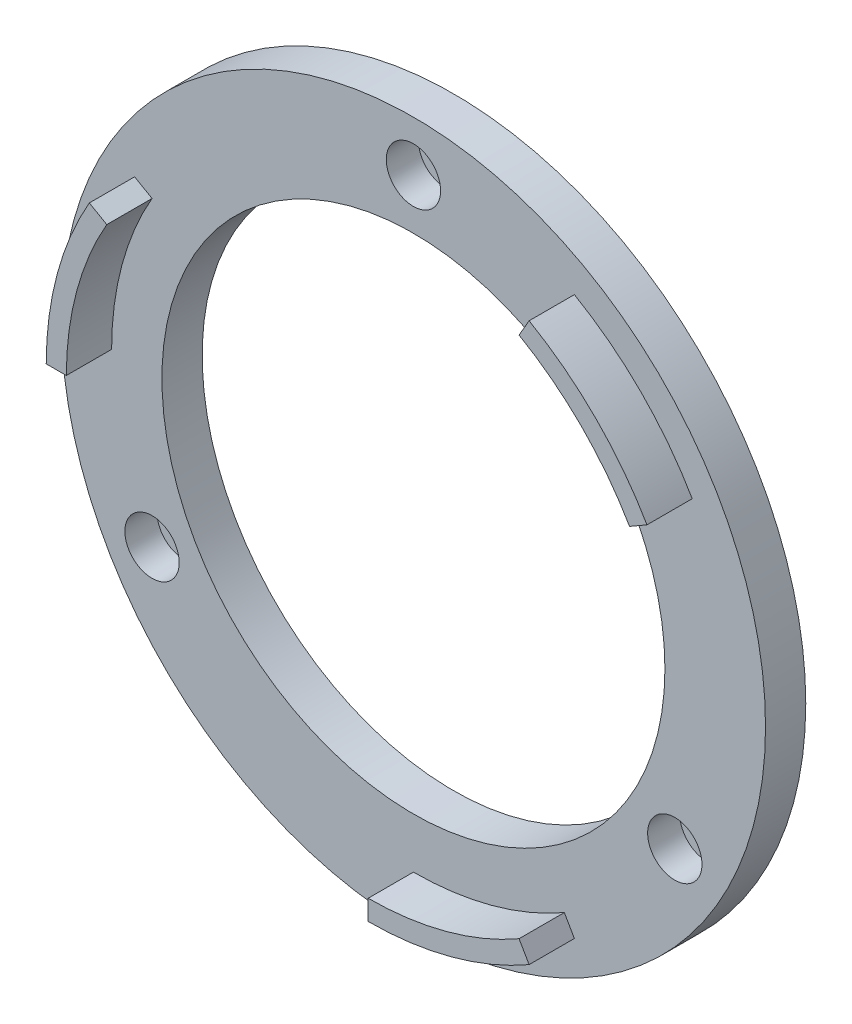
ISO-10303-21;
HEADER;
FILE_DESCRIPTION(('STEP AP214'),'2;1');
FILE_NAME('part.step','',(''),(''),'','','');
FILE_SCHEMA(('AUTOMOTIVE_DESIGN { 1 0 10303 214 1 1 1 1 }'));
ENDSEC;
DATA;
#1=APPLICATION_CONTEXT('core data for automotive mechanical design processes');
#2=APPLICATION_PROTOCOL_DEFINITION('international standard','automotive_design',2000,#1);
#3=PRODUCT_CONTEXT('',#1,'mechanical');
#4=PRODUCT('Part','Part','',(#3));
#5=PRODUCT_RELATED_PRODUCT_CATEGORY('part','',(#4));
#6=PRODUCT_DEFINITION_FORMATION('','',#4);
#7=PRODUCT_DEFINITION_CONTEXT('part definition',#1,'design');
#8=PRODUCT_DEFINITION('design','',#6,#7);
#9=PRODUCT_DEFINITION_SHAPE('','',#8);
#10=(LENGTH_UNIT() NAMED_UNIT(*) SI_UNIT(.MILLI.,.METRE.));
#11=(NAMED_UNIT(*) PLANE_ANGLE_UNIT() SI_UNIT($,.RADIAN.));
#12=(NAMED_UNIT(*) SI_UNIT($,.STERADIAN.) SOLID_ANGLE_UNIT());
#13=UNCERTAINTY_MEASURE_WITH_UNIT(LENGTH_MEASURE(1.E-05),#10,'distance_accuracy_value','');
#14=(GEOMETRIC_REPRESENTATION_CONTEXT(3) GLOBAL_UNCERTAINTY_ASSIGNED_CONTEXT((#13)) GLOBAL_UNIT_ASSIGNED_CONTEXT((#10,
#11,#12)) REPRESENTATION_CONTEXT('',''));
#15=CARTESIAN_POINT('',(0.,0.,0.));
#16=DIRECTION('',(0.,0.,1.));
#17=DIRECTION('',(1.,0.,0.));
#18=AXIS2_PLACEMENT_3D('',#15,#16,#17);
#19=CARTESIAN_POINT('',(-25.9807621135351,-14.9999999999989,7.9));
#20=DIRECTION('',(0.,0.,-1.));
#21=DIRECTION('',(-1.,0.,0.));
#22=AXIS2_PLACEMENT_3D('',#19,#20,#21);
#23=CYLINDRICAL_SURFACE('',#22,1.60000000000166);
#24=CARTESIAN_POINT('',(-25.9807621135351,-14.9999999999989,0.8));
#25=DIRECTION('',(0.,0.,1.));
#26=DIRECTION('',(1.,0.,0.));
#27=AXIS2_PLACEMENT_3D('',#24,#25,#26);
#28=CIRCLE('',#27,1.60000000000166);
#29=CARTESIAN_POINT('',(-24.3807621135334,-14.9999999999989,0.8));
#30=VERTEX_POINT('',#29);
#31=EDGE_CURVE('E43',#30,#30,#28,.F.);
#32=ORIENTED_EDGE('',*,*,#31,.F.);
#33=EDGE_LOOP('',(#32));
#34=FACE_BOUND('',#33,.T.);
#35=CARTESIAN_POINT('',(-25.9807621135351,-14.9999999999989,0.));
#36=DIRECTION('',(0.,0.,-1.));
#37=DIRECTION('',(-1.,0.,0.));
#38=AXIS2_PLACEMENT_3D('',#35,#36,#37);
#39=CIRCLE('',#38,1.60000000000166);
#40=CARTESIAN_POINT('',(-27.5807621135367,-14.9999999999989,0.));
#41=VERTEX_POINT('',#40);
#42=EDGE_CURVE('E267',#41,#41,#39,.F.);
#43=ORIENTED_EDGE('',*,*,#42,.F.);
#44=EDGE_LOOP('',(#43));
#45=FACE_BOUND('',#44,.T.);
#46=ADVANCED_FACE('F39',(#34,#45),#23,.F.);
#47=CARTESIAN_POINT('',(25.9807621135312,-15.0000000000011,7.9));
#48=DIRECTION('',(0.,0.,-1.));
#49=DIRECTION('',(-1.,0.,0.));
#50=AXIS2_PLACEMENT_3D('',#47,#48,#49);
#51=CYLINDRICAL_SURFACE('',#50,1.60000000000243);
#52=CARTESIAN_POINT('',(25.9807621135312,-15.0000000000011,0.8));
#53=DIRECTION('',(0.,0.,1.));
#54=DIRECTION('',(1.,0.,0.));
#55=AXIS2_PLACEMENT_3D('',#52,#53,#54);
#56=CIRCLE('',#55,1.60000000000243);
#57=CARTESIAN_POINT('',(27.5807621135337,-15.0000000000011,0.8));
#58=VERTEX_POINT('',#57);
#59=EDGE_CURVE('E252',#58,#58,#56,.F.);
#60=ORIENTED_EDGE('',*,*,#59,.F.);
#61=EDGE_LOOP('',(#60));
#62=FACE_BOUND('',#61,.T.);
#63=CARTESIAN_POINT('',(25.9807621135312,-15.0000000000011,0.));
#64=DIRECTION('',(0.,0.,-1.));
#65=DIRECTION('',(-1.,0.,0.));
#66=AXIS2_PLACEMENT_3D('',#63,#64,#65);
#67=CIRCLE('',#66,1.60000000000243);
#68=CARTESIAN_POINT('',(24.3807621135288,-15.0000000000011,0.));
#69=VERTEX_POINT('',#68);
#70=EDGE_CURVE('E269',#69,#69,#67,.F.);
#71=ORIENTED_EDGE('',*,*,#70,.F.);
#72=EDGE_LOOP('',(#71));
#73=FACE_BOUND('',#72,.T.);
#74=ADVANCED_FACE('F263',(#62,#73),#51,.F.);
#75=CARTESIAN_POINT('',(0.,30.,7.9));
#76=DIRECTION('',(0.,0.,-1.));
#77=DIRECTION('',(-1.,0.,0.));
#78=AXIS2_PLACEMENT_3D('',#75,#76,#77);
#79=CYLINDRICAL_SURFACE('',#78,1.6);
#80=CARTESIAN_POINT('',(0.,30.,0.8));
#81=DIRECTION('',(0.,0.,1.));
#82=DIRECTION('',(1.,0.,0.));
#83=AXIS2_PLACEMENT_3D('',#80,#81,#82);
#84=CIRCLE('',#83,1.6);
#85=CARTESIAN_POINT('',(1.6,30.,0.8));
#86=VERTEX_POINT('',#85);
#87=EDGE_CURVE('E228',#86,#86,#84,.F.);
#88=ORIENTED_EDGE('',*,*,#87,.F.);
#89=EDGE_LOOP('',(#88));
#90=FACE_BOUND('',#89,.T.);
#91=CARTESIAN_POINT('',(0.,30.,0.));
#92=DIRECTION('',(0.,0.,-1.));
#93=DIRECTION('',(-1.,0.,0.));
#94=AXIS2_PLACEMENT_3D('',#91,#92,#93);
#95=CIRCLE('',#94,1.6);
#96=CARTESIAN_POINT('',(-1.6,30.,0.));
#97=VERTEX_POINT('',#96);
#98=EDGE_CURVE('E272',#97,#97,#95,.F.);
#99=ORIENTED_EDGE('',*,*,#98,.F.);
#100=EDGE_LOOP('',(#99));
#101=FACE_BOUND('',#100,.T.);
#102=ADVANCED_FACE('F359',(#90,#101),#79,.F.);
#103=CARTESIAN_POINT('',(0.,0.,4.));
#104=DIRECTION('',(0.,0.,1.));
#105=DIRECTION('',(1.,0.,0.));
#106=AXIS2_PLACEMENT_3D('',#103,#104,#105);
#107=PLANE('',#106);
#108=CARTESIAN_POINT('',(0.,0.,4.));
#109=DIRECTION('',(0.,0.,1.));
#110=DIRECTION('',(1.,0.,0.));
#111=AXIS2_PLACEMENT_3D('',#108,#109,#110);
#112=CIRCLE('',#111,30.);
#113=CARTESIAN_POINT('',(25.9807621135331,15.,4.));
#114=VERTEX_POINT('',#113);
#115=CARTESIAN_POINT('',(14.9999999999999,25.9807621135332,4.));
#116=VERTEX_POINT('',#115);
#117=EDGE_CURVE('E184',#114,#116,#112,.T.);
#118=ORIENTED_EDGE('',*,*,#117,.T.);
#119=DIRECTION('',(0.499999999999998,0.86602540378444,0.));
#120=VECTOR('',#119,1.);
#121=CARTESIAN_POINT('',(0.,0.,4.));
#122=LINE('',#121,#120);
#123=CARTESIAN_POINT('',(15.9999999999999,27.7128129211021,4.));
#124=VERTEX_POINT('',#123);
#125=EDGE_CURVE('E197',#116,#124,#122,.T.);
#126=ORIENTED_EDGE('',*,*,#125,.T.);
#127=CARTESIAN_POINT('',(0.,0.,4.));
#128=DIRECTION('',(0.,0.,1.));
#129=DIRECTION('',(1.,0.,0.));
#130=AXIS2_PLACEMENT_3D('',#127,#128,#129);
#131=CIRCLE('',#130,32.);
#132=CARTESIAN_POINT('',(27.712812921102,16.,4.));
#133=VERTEX_POINT('',#132);
#134=EDGE_CURVE('E209',#133,#124,#131,.T.);
#135=ORIENTED_EDGE('',*,*,#134,.F.);
#136=DIRECTION('',(0.866025403784438,0.500000000000001,0.));
#137=VECTOR('',#136,1.);
#138=CARTESIAN_POINT('',(0.,0.,4.));
#139=LINE('',#138,#137);
#140=EDGE_CURVE('E206',#114,#133,#139,.T.);
#141=ORIENTED_EDGE('',*,*,#140,.F.);
#142=EDGE_LOOP('',(#118,#126,#135,#141));
#143=FACE_BOUND('',#142,.T.);
#144=CARTESIAN_POINT('',(0.,30.,4.));
#145=DIRECTION('',(0.,0.,1.));
#146=DIRECTION('',(1.,0.,0.));
#147=AXIS2_PLACEMENT_3D('',#144,#145,#146);
#148=CIRCLE('',#147,2.7);
#149=CARTESIAN_POINT('',(2.7,30.,4.));
#150=VERTEX_POINT('',#149);
#151=EDGE_CURVE('E229',#150,#150,#148,.T.);
#152=ORIENTED_EDGE('',*,*,#151,.F.);
#153=EDGE_LOOP('',(#152));
#154=FACE_BOUND('',#153,.T.);
#155=CARTESIAN_POINT('',(25.9807621135351,-14.9999999999989,4.));
#156=DIRECTION('',(0.,0.,1.));
#157=DIRECTION('',(1.,0.,0.));
#158=AXIS2_PLACEMENT_3D('',#155,#156,#157);
#159=CIRCLE('',#158,2.70000000000167);
#160=CARTESIAN_POINT('',(28.6807621135367,-14.9999999999989,4.));
#161=VERTEX_POINT('',#160);
#162=EDGE_CURVE('E232',#161,#161,#159,.T.);
#163=ORIENTED_EDGE('',*,*,#162,.F.);
#164=EDGE_LOOP('',(#163));
#165=FACE_BOUND('',#164,.T.);
#166=CARTESIAN_POINT('',(-25.9807621135312,-15.0000000000011,4.));
#167=DIRECTION('',(0.,0.,1.));
#168=DIRECTION('',(1.,0.,0.));
#169=AXIS2_PLACEMENT_3D('',#166,#167,#168);
#170=CIRCLE('',#169,2.70000000000243);
#171=CARTESIAN_POINT('',(-23.2807621135288,-15.0000000000011,4.));
#172=VERTEX_POINT('',#171);
#173=EDGE_CURVE('E238',#172,#172,#170,.T.);
#174=ORIENTED_EDGE('',*,*,#173,.F.);
#175=EDGE_LOOP('',(#174));
#176=FACE_BOUND('',#175,.T.);
#177=CARTESIAN_POINT('',(0.,0.,4.));
#178=DIRECTION('',(0.,0.,1.));
#179=DIRECTION('',(1.,0.,0.));
#180=AXIS2_PLACEMENT_3D('',#177,#178,#179);
#181=CIRCLE('',#180,35.);
#182=CARTESIAN_POINT('',(35.,0.,4.));
#183=VERTEX_POINT('',#182);
#184=EDGE_CURVE('E48',#183,#183,#181,.T.);
#185=ORIENTED_EDGE('',*,*,#184,.T.);
#186=EDGE_LOOP('',(#185));
#187=FACE_BOUND('',#186,.T.);
#188=CARTESIAN_POINT('',(0.,0.,4.));
#189=DIRECTION('',(0.,0.,1.));
#190=DIRECTION('',(1.,0.,0.));
#191=AXIS2_PLACEMENT_3D('',#188,#189,#190);
#192=CIRCLE('',#191,25.);
#193=CARTESIAN_POINT('',(25.,0.,4.));
#194=VERTEX_POINT('',#193);
#195=EDGE_CURVE('E11',#194,#194,#192,.T.);
#196=ORIENTED_EDGE('',*,*,#195,.F.);
#197=EDGE_LOOP('',(#196));
#198=FACE_BOUND('',#197,.T.);
#199=DIRECTION('',(1.,0.,0.));
#200=VECTOR('',#199,1.);
#201=CARTESIAN_POINT('',(-32.,2.15105711021124E-13,4.));
#202=LINE('',#201,#200);
#203=CARTESIAN_POINT('',(-32.,2.15105711021124E-13,4.));
#204=VERTEX_POINT('',#203);
#205=CARTESIAN_POINT('',(-30.,2.02962646689286E-13,4.));
#206=VERTEX_POINT('',#205);
#207=EDGE_CURVE('E178',#204,#206,#202,.T.);
#208=ORIENTED_EDGE('',*,*,#207,.F.);
#209=CARTESIAN_POINT('',(0.,0.,4.));
#210=DIRECTION('',(0.,0.,1.));
#211=DIRECTION('',(1.,0.,0.));
#212=AXIS2_PLACEMENT_3D('',#209,#210,#211);
#213=CIRCLE('',#212,32.);
#214=CARTESIAN_POINT('',(-27.7128129211019,16.0000000000002,4.));
#215=VERTEX_POINT('',#214);
#216=EDGE_CURVE('E181',#215,#204,#213,.T.);
#217=ORIENTED_EDGE('',*,*,#216,.F.);
#218=DIRECTION('',(-0.866025403784435,0.500000000000007,0.));
#219=VECTOR('',#218,1.);
#220=CARTESIAN_POINT('',(-25.980762113533,15.0000000000002,4.));
#221=LINE('',#220,#219);
#222=CARTESIAN_POINT('',(-25.980762113533,15.0000000000002,4.));
#223=VERTEX_POINT('',#222);
#224=EDGE_CURVE('E174',#223,#215,#221,.T.);
#225=ORIENTED_EDGE('',*,*,#224,.F.);
#226=CARTESIAN_POINT('',(0.,0.,4.));
#227=DIRECTION('',(0.,0.,1.));
#228=DIRECTION('',(1.,0.,0.));
#229=AXIS2_PLACEMENT_3D('',#226,#227,#228);
#230=CIRCLE('',#229,30.);
#231=EDGE_CURVE('E64',#223,#206,#230,.T.);
#232=ORIENTED_EDGE('',*,*,#231,.T.);
#233=EDGE_LOOP('',(#208,#217,#225,#232));
#234=FACE_BOUND('',#233,.T.);
#235=DIRECTION('',(-0.499999999999998,0.86602540378444,0.));
#236=VECTOR('',#235,1.);
#237=CARTESIAN_POINT('',(15.9999999999999,-27.7128129211021,4.));
#238=LINE('',#237,#236);
#239=CARTESIAN_POINT('',(15.9999999999999,-27.7128129211021,4.));
#240=VERTEX_POINT('',#239);
#241=CARTESIAN_POINT('',(14.9999999999999,-25.9807621135332,4.));
#242=VERTEX_POINT('',#241);
#243=EDGE_CURVE('E152',#240,#242,#238,.T.);
#244=ORIENTED_EDGE('',*,*,#243,.F.);
#245=CARTESIAN_POINT('',(0.,0.,4.));
#246=DIRECTION('',(0.,0.,1.));
#247=DIRECTION('',(1.,0.,0.));
#248=AXIS2_PLACEMENT_3D('',#245,#246,#247);
#249=CIRCLE('',#248,32.);
#250=CARTESIAN_POINT('',(-1.12757025938492E-13,-32.,4.));
#251=VERTEX_POINT('',#250);
#252=EDGE_CURVE('E145',#251,#240,#249,.T.);
#253=ORIENTED_EDGE('',*,*,#252,.F.);
#254=DIRECTION('',(0.,-1.,0.));
#255=VECTOR('',#254,1.);
#256=CARTESIAN_POINT('',(-1.05818132034585E-13,-30.,4.));
#257=LINE('',#256,#255);
#258=CARTESIAN_POINT('',(-1.05818132034585E-13,-30.,4.));
#259=VERTEX_POINT('',#258);
#260=EDGE_CURVE('E130',#259,#251,#257,.T.);
#261=ORIENTED_EDGE('',*,*,#260,.F.);
#262=CARTESIAN_POINT('',(0.,0.,4.));
#263=DIRECTION('',(0.,0.,1.));
#264=DIRECTION('',(1.,0.,0.));
#265=AXIS2_PLACEMENT_3D('',#262,#263,#264);
#266=CIRCLE('',#265,30.);
#267=EDGE_CURVE('E56',#259,#242,#266,.T.);
#268=ORIENTED_EDGE('',*,*,#267,.T.);
#269=EDGE_LOOP('',(#244,#253,#261,#268));
#270=FACE_BOUND('',#269,.T.);
#271=ADVANCED_FACE('F150',(#143,#154,#165,#176,#187,#198,#234,#270),#107,.T.);
#272=CARTESIAN_POINT('',(0.,0.,4.));
#273=DIRECTION('',(0.,0.,-1.));
#274=DIRECTION('',(-1.,0.,0.));
#275=AXIS2_PLACEMENT_3D('',#272,#273,#274);
#276=CYLINDRICAL_SURFACE('',#275,35.);
#277=ORIENTED_EDGE('',*,*,#184,.F.);
#278=EDGE_LOOP('',(#277));
#279=FACE_BOUND('',#278,.T.);
#280=CARTESIAN_POINT('',(0.,0.,0.));
#281=DIRECTION('',(0.,0.,1.));
#282=DIRECTION('',(1.,0.,0.));
#283=AXIS2_PLACEMENT_3D('',#280,#281,#282);
#284=CIRCLE('',#283,35.);
#285=CARTESIAN_POINT('',(35.,0.,0.));
#286=VERTEX_POINT('',#285);
#287=EDGE_CURVE('E246',#286,#286,#284,.T.);
#288=ORIENTED_EDGE('',*,*,#287,.T.);
#289=EDGE_LOOP('',(#288));
#290=FACE_BOUND('',#289,.T.);
#291=ADVANCED_FACE('F41',(#279,#290),#276,.T.);
#292=CARTESIAN_POINT('',(0.,0.,4.));
#293=DIRECTION('',(0.,0.,-1.));
#294=DIRECTION('',(-1.,0.,0.));
#295=AXIS2_PLACEMENT_3D('',#292,#293,#294);
#296=CYLINDRICAL_SURFACE('',#295,25.);
#297=ORIENTED_EDGE('',*,*,#195,.T.);
#298=EDGE_LOOP('',(#297));
#299=FACE_BOUND('',#298,.T.);
#300=CARTESIAN_POINT('',(0.,0.,0.));
#301=DIRECTION('',(0.,0.,1.));
#302=DIRECTION('',(1.,0.,0.));
#303=AXIS2_PLACEMENT_3D('',#300,#301,#302);
#304=CIRCLE('',#303,25.);
#305=CARTESIAN_POINT('',(25.,0.,0.));
#306=VERTEX_POINT('',#305);
#307=EDGE_CURVE('E244',#306,#306,#304,.T.);
#308=ORIENTED_EDGE('',*,*,#307,.F.);
#309=EDGE_LOOP('',(#308));
#310=FACE_BOUND('',#309,.T.);
#311=ADVANCED_FACE('F370',(#299,#310),#296,.F.);
#312=CARTESIAN_POINT('',(0.,0.,0.));
#313=DIRECTION('',(0.,0.,1.));
#314=DIRECTION('',(1.,0.,0.));
#315=AXIS2_PLACEMENT_3D('',#312,#313,#314);
#316=PLANE('',#315);
#317=ORIENTED_EDGE('',*,*,#287,.F.);
#318=EDGE_LOOP('',(#317));
#319=FACE_BOUND('',#318,.T.);
#320=ORIENTED_EDGE('',*,*,#307,.T.);
#321=EDGE_LOOP('',(#320));
#322=FACE_BOUND('',#321,.T.);
#323=ORIENTED_EDGE('',*,*,#42,.T.);
#324=EDGE_LOOP('',(#323));
#325=FACE_BOUND('',#324,.T.);
#326=ORIENTED_EDGE('',*,*,#70,.T.);
#327=EDGE_LOOP('',(#326));
#328=FACE_BOUND('',#327,.T.);
#329=ORIENTED_EDGE('',*,*,#98,.T.);
#330=EDGE_LOOP('',(#329));
#331=FACE_BOUND('',#330,.T.);
#332=ADVANCED_FACE('F340',(#319,#322,#325,#328,#331),#316,.F.);
#333=CARTESIAN_POINT('',(0.,30.,0.8));
#334=DIRECTION('',(0.,0.,1.));
#335=DIRECTION('',(1.,0.,0.));
#336=AXIS2_PLACEMENT_3D('',#333,#334,#335);
#337=PLANE('',#336);
#338=CARTESIAN_POINT('',(0.,30.,0.8));
#339=DIRECTION('',(0.,0.,1.));
#340=DIRECTION('',(1.,0.,0.));
#341=AXIS2_PLACEMENT_3D('',#338,#339,#340);
#342=CIRCLE('',#341,2.7);
#343=CARTESIAN_POINT('',(2.7,30.,0.8));
#344=VERTEX_POINT('',#343);
#345=EDGE_CURVE('E225',#344,#344,#342,.T.);
#346=ORIENTED_EDGE('',*,*,#345,.T.);
#347=EDGE_LOOP('',(#346));
#348=FACE_BOUND('',#347,.T.);
#349=ORIENTED_EDGE('',*,*,#87,.T.);
#350=EDGE_LOOP('',(#349));
#351=FACE_BOUND('',#350,.T.);
#352=ADVANCED_FACE('F336',(#348,#351),#337,.T.);
#353=CARTESIAN_POINT('',(0.,30.,0.8));
#354=DIRECTION('',(0.,0.,1.));
#355=DIRECTION('',(1.,0.,0.));
#356=AXIS2_PLACEMENT_3D('',#353,#354,#355);
#357=CYLINDRICAL_SURFACE('',#356,2.7);
#358=ORIENTED_EDGE('',*,*,#345,.F.);
#359=EDGE_LOOP('',(#358));
#360=FACE_BOUND('',#359,.T.);
#361=ORIENTED_EDGE('',*,*,#151,.T.);
#362=EDGE_LOOP('',(#361));
#363=FACE_BOUND('',#362,.T.);
#364=ADVANCED_FACE('F339',(#360,#363),#357,.F.);
#365=CARTESIAN_POINT('',(25.9807621135351,-14.9999999999989,0.8));
#366=DIRECTION('',(0.,0.,1.));
#367=DIRECTION('',(1.,0.,0.));
#368=AXIS2_PLACEMENT_3D('',#365,#366,#367);
#369=PLANE('',#368);
#370=CARTESIAN_POINT('',(25.9807621135351,-14.9999999999989,0.8));
#371=DIRECTION('',(0.,0.,1.));
#372=DIRECTION('',(1.,0.,0.));
#373=AXIS2_PLACEMENT_3D('',#370,#371,#372);
#374=CIRCLE('',#373,2.70000000000167);
#375=CARTESIAN_POINT('',(28.6807621135367,-14.9999999999989,0.8));
#376=VERTEX_POINT('',#375);
#377=EDGE_CURVE('E235',#376,#376,#374,.T.);
#378=ORIENTED_EDGE('',*,*,#377,.T.);
#379=EDGE_LOOP('',(#378));
#380=FACE_BOUND('',#379,.T.);
#381=ORIENTED_EDGE('',*,*,#59,.T.);
#382=EDGE_LOOP('',(#381));
#383=FACE_BOUND('',#382,.T.);
#384=ADVANCED_FACE('F344',(#380,#383),#369,.T.);
#385=CARTESIAN_POINT('',(25.9807621135351,-14.9999999999989,0.8));
#386=DIRECTION('',(0.,0.,1.));
#387=DIRECTION('',(1.,0.,0.));
#388=AXIS2_PLACEMENT_3D('',#385,#386,#387);
#389=CYLINDRICAL_SURFACE('',#388,2.70000000000167);
#390=ORIENTED_EDGE('',*,*,#377,.F.);
#391=EDGE_LOOP('',(#390));
#392=FACE_BOUND('',#391,.T.);
#393=ORIENTED_EDGE('',*,*,#162,.T.);
#394=EDGE_LOOP('',(#393));
#395=FACE_BOUND('',#394,.T.);
#396=ADVANCED_FACE('F346',(#392,#395),#389,.F.);
#397=CARTESIAN_POINT('',(-25.9807621135312,-15.0000000000011,0.8));
#398=DIRECTION('',(0.,0.,1.));
#399=DIRECTION('',(1.,0.,0.));
#400=AXIS2_PLACEMENT_3D('',#397,#398,#399);
#401=PLANE('',#400);
#402=CARTESIAN_POINT('',(-25.9807621135312,-15.0000000000011,0.8));
#403=DIRECTION('',(0.,0.,1.));
#404=DIRECTION('',(1.,0.,0.));
#405=AXIS2_PLACEMENT_3D('',#402,#403,#404);
#406=CIRCLE('',#405,2.70000000000243);
#407=CARTESIAN_POINT('',(-23.2807621135288,-15.0000000000011,0.8));
#408=VERTEX_POINT('',#407);
#409=EDGE_CURVE('E224',#408,#408,#406,.T.);
#410=ORIENTED_EDGE('',*,*,#409,.T.);
#411=EDGE_LOOP('',(#410));
#412=FACE_BOUND('',#411,.T.);
#413=ORIENTED_EDGE('',*,*,#31,.T.);
#414=EDGE_LOOP('',(#413));
#415=FACE_BOUND('',#414,.T.);
#416=ADVANCED_FACE('F259',(#412,#415),#401,.T.);
#417=CARTESIAN_POINT('',(-25.9807621135312,-15.0000000000011,0.8));
#418=DIRECTION('',(0.,0.,1.));
#419=DIRECTION('',(1.,0.,0.));
#420=AXIS2_PLACEMENT_3D('',#417,#418,#419);
#421=CYLINDRICAL_SURFACE('',#420,2.70000000000243);
#422=ORIENTED_EDGE('',*,*,#409,.F.);
#423=EDGE_LOOP('',(#422));
#424=FACE_BOUND('',#423,.T.);
#425=ORIENTED_EDGE('',*,*,#173,.T.);
#426=EDGE_LOOP('',(#425));
#427=FACE_BOUND('',#426,.T.);
#428=ADVANCED_FACE('F334',(#424,#427),#421,.F.);
#429=CARTESIAN_POINT('',(0.,0.,8.5));
#430=DIRECTION('',(0.,0.,-1.));
#431=DIRECTION('',(-1.,0.,0.));
#432=AXIS2_PLACEMENT_3D('',#429,#430,#431);
#433=CYLINDRICAL_SURFACE('',#432,30.);
#434=ORIENTED_EDGE('',*,*,#117,.F.);
#435=DIRECTION('',(0.,0.,-1.));
#436=VECTOR('',#435,1.);
#437=CARTESIAN_POINT('',(25.9807621135331,15.,8.5));
#438=LINE('',#437,#436);
#439=CARTESIAN_POINT('',(25.9807621135331,15.,8.5));
#440=VERTEX_POINT('',#439);
#441=EDGE_CURVE('E221',#440,#114,#438,.T.);
#442=ORIENTED_EDGE('',*,*,#441,.F.);
#443=CARTESIAN_POINT('',(0.,0.,8.5));
#444=DIRECTION('',(0.,0.,1.));
#445=DIRECTION('',(1.,0.,0.));
#446=AXIS2_PLACEMENT_3D('',#443,#444,#445);
#447=CIRCLE('',#446,30.);
#448=CARTESIAN_POINT('',(14.9999999999999,25.9807621135332,8.5));
#449=VERTEX_POINT('',#448);
#450=EDGE_CURVE('E193',#440,#449,#447,.T.);
#451=ORIENTED_EDGE('',*,*,#450,.T.);
#452=DIRECTION('',(0.,0.,-1.));
#453=VECTOR('',#452,1.);
#454=CARTESIAN_POINT('',(14.9999999999999,25.9807621135332,8.5));
#455=LINE('',#454,#453);
#456=EDGE_CURVE('E204',#449,#116,#455,.T.);
#457=ORIENTED_EDGE('',*,*,#456,.T.);
#458=EDGE_LOOP('',(#434,#442,#451,#457));
#459=FACE_BOUND('',#458,.T.);
#460=ADVANCED_FACE('F330',(#459),#433,.F.);
#461=CARTESIAN_POINT('',(0.,0.,8.5));
#462=DIRECTION('',(-0.500000000000001,0.866025403784438,0.));
#463=DIRECTION('',(-0.866025403784438,-0.500000000000001,0.));
#464=AXIS2_PLACEMENT_3D('',#461,#462,#463);
#465=PLANE('',#464);
#466=ORIENTED_EDGE('',*,*,#140,.T.);
#467=DIRECTION('',(0.,0.,-1.));
#468=VECTOR('',#467,1.);
#469=CARTESIAN_POINT('',(27.712812921102,16.,8.5));
#470=LINE('',#469,#468);
#471=CARTESIAN_POINT('',(27.712812921102,16.,8.5));
#472=VERTEX_POINT('',#471);
#473=EDGE_CURVE('E218',#472,#133,#470,.T.);
#474=ORIENTED_EDGE('',*,*,#473,.F.);
#475=DIRECTION('',(0.866025403784438,0.500000000000001,0.));
#476=VECTOR('',#475,1.);
#477=CARTESIAN_POINT('',(0.,0.,8.5));
#478=LINE('',#477,#476);
#479=EDGE_CURVE('E196',#440,#472,#478,.T.);
#480=ORIENTED_EDGE('',*,*,#479,.F.);
#481=ORIENTED_EDGE('',*,*,#441,.T.);
#482=EDGE_LOOP('',(#466,#474,#480,#481));
#483=FACE_BOUND('',#482,.T.);
#484=ADVANCED_FACE('F326',(#483),#465,.F.);
#485=CARTESIAN_POINT('',(0.,0.,8.5));
#486=DIRECTION('',(0.,0.,-1.));
#487=DIRECTION('',(-1.,0.,0.));
#488=AXIS2_PLACEMENT_3D('',#485,#486,#487);
#489=CYLINDRICAL_SURFACE('',#488,32.);
#490=ORIENTED_EDGE('',*,*,#134,.T.);
#491=DIRECTION('',(0.,0.,-1.));
#492=VECTOR('',#491,1.);
#493=CARTESIAN_POINT('',(15.9999999999999,27.7128129211021,8.5));
#494=LINE('',#493,#492);
#495=CARTESIAN_POINT('',(15.9999999999999,27.7128129211021,8.5));
#496=VERTEX_POINT('',#495);
#497=EDGE_CURVE('E215',#496,#124,#494,.T.);
#498=ORIENTED_EDGE('',*,*,#497,.F.);
#499=CARTESIAN_POINT('',(0.,0.,8.5));
#500=DIRECTION('',(0.,0.,1.));
#501=DIRECTION('',(1.,0.,0.));
#502=AXIS2_PLACEMENT_3D('',#499,#500,#501);
#503=CIRCLE('',#502,32.);
#504=EDGE_CURVE('E199',#472,#496,#503,.T.);
#505=ORIENTED_EDGE('',*,*,#504,.F.);
#506=ORIENTED_EDGE('',*,*,#473,.T.);
#507=EDGE_LOOP('',(#490,#498,#505,#506));
#508=FACE_BOUND('',#507,.T.);
#509=ADVANCED_FACE('F322',(#508),#489,.T.);
#510=CARTESIAN_POINT('',(0.,0.,8.5));
#511=DIRECTION('',(-0.86602540378444,0.499999999999998,0.));
#512=DIRECTION('',(-0.499999999999998,-0.86602540378444,0.));
#513=AXIS2_PLACEMENT_3D('',#510,#511,#512);
#514=PLANE('',#513);
#515=ORIENTED_EDGE('',*,*,#125,.F.);
#516=ORIENTED_EDGE('',*,*,#456,.F.);
#517=DIRECTION('',(0.499999999999998,0.86602540378444,0.));
#518=VECTOR('',#517,1.);
#519=CARTESIAN_POINT('',(0.,0.,8.5));
#520=LINE('',#519,#518);
#521=EDGE_CURVE('E201',#449,#496,#520,.T.);
#522=ORIENTED_EDGE('',*,*,#521,.T.);
#523=ORIENTED_EDGE('',*,*,#497,.T.);
#524=EDGE_LOOP('',(#515,#516,#522,#523));
#525=FACE_BOUND('',#524,.T.);
#526=ADVANCED_FACE('F318',(#525),#514,.T.);
#527=CARTESIAN_POINT('',(0.,0.,8.5));
#528=DIRECTION('',(0.,0.,1.));
#529=DIRECTION('',(1.,0.,0.));
#530=AXIS2_PLACEMENT_3D('',#527,#528,#529);
#531=PLANE('',#530);
#532=ORIENTED_EDGE('',*,*,#450,.F.);
#533=ORIENTED_EDGE('',*,*,#479,.T.);
#534=ORIENTED_EDGE('',*,*,#504,.T.);
#535=ORIENTED_EDGE('',*,*,#521,.F.);
#536=EDGE_LOOP('',(#532,#533,#534,#535));
#537=FACE_BOUND('',#536,.T.);
#538=ADVANCED_FACE('F300',(#537),#531,.T.);
#539=CARTESIAN_POINT('',(0.,0.,8.5));
#540=DIRECTION('',(0.,0.,-1.));
#541=DIRECTION('',(-1.,0.,0.));
#542=AXIS2_PLACEMENT_3D('',#539,#540,#541);
#543=CYLINDRICAL_SURFACE('',#542,32.);
#544=ORIENTED_EDGE('',*,*,#216,.T.);
#545=DIRECTION('',(0.,0.,-1.));
#546=VECTOR('',#545,1.);
#547=CARTESIAN_POINT('',(-32.,2.15105711021124E-13,8.5));
#548=LINE('',#547,#546);
#549=CARTESIAN_POINT('',(-32.,2.15105711021124E-13,8.5));
#550=VERTEX_POINT('',#549);
#551=EDGE_CURVE('E153',#550,#204,#548,.T.);
#552=ORIENTED_EDGE('',*,*,#551,.F.);
#553=CARTESIAN_POINT('',(0.,0.,8.5));
#554=DIRECTION('',(0.,0.,1.));
#555=DIRECTION('',(1.,0.,0.));
#556=AXIS2_PLACEMENT_3D('',#553,#554,#555);
#557=CIRCLE('',#556,32.);
#558=CARTESIAN_POINT('',(-27.7128129211019,16.0000000000002,8.5));
#559=VERTEX_POINT('',#558);
#560=EDGE_CURVE('E176',#559,#550,#557,.T.);
#561=ORIENTED_EDGE('',*,*,#560,.F.);
#562=DIRECTION('',(0.,0.,-1.));
#563=VECTOR('',#562,1.);
#564=CARTESIAN_POINT('',(-27.7128129211019,16.0000000000002,8.5));
#565=LINE('',#564,#563);
#566=EDGE_CURVE('E170',#559,#215,#565,.T.);
#567=ORIENTED_EDGE('',*,*,#566,.T.);
#568=EDGE_LOOP('',(#544,#552,#561,#567));
#569=FACE_BOUND('',#568,.T.);
#570=ADVANCED_FACE('F296',(#569),#543,.T.);
#571=CARTESIAN_POINT('',(-32.,2.15105711021124E-13,8.5));
#572=DIRECTION('',(0.,1.,0.));
#573=DIRECTION('',(-1.,0.,0.));
#574=AXIS2_PLACEMENT_3D('',#571,#572,#573);
#575=PLANE('',#574);
#576=ORIENTED_EDGE('',*,*,#207,.T.);
#577=DIRECTION('',(0.,0.,-1.));
#578=VECTOR('',#577,1.);
#579=CARTESIAN_POINT('',(-30.,2.02962646689286E-13,8.5));
#580=LINE('',#579,#578);
#581=CARTESIAN_POINT('',(-30.,2.02962646689286E-13,8.5));
#582=VERTEX_POINT('',#581);
#583=EDGE_CURVE('E155',#582,#206,#580,.T.);
#584=ORIENTED_EDGE('',*,*,#583,.F.);
#585=DIRECTION('',(1.,0.,0.));
#586=VECTOR('',#585,1.);
#587=CARTESIAN_POINT('',(-32.,2.15105711021124E-13,8.5));
#588=LINE('',#587,#586);
#589=EDGE_CURVE('E189',#550,#582,#588,.T.);
#590=ORIENTED_EDGE('',*,*,#589,.F.);
#591=ORIENTED_EDGE('',*,*,#551,.T.);
#592=EDGE_LOOP('',(#576,#584,#590,#591));
#593=FACE_BOUND('',#592,.T.);
#594=ADVANCED_FACE('F299',(#593),#575,.F.);
#595=CARTESIAN_POINT('',(0.,0.,8.5));
#596=DIRECTION('',(0.,0.,-1.));
#597=DIRECTION('',(-1.,0.,0.));
#598=AXIS2_PLACEMENT_3D('',#595,#596,#597);
#599=CYLINDRICAL_SURFACE('',#598,30.);
#600=ORIENTED_EDGE('',*,*,#231,.F.);
#601=DIRECTION('',(0.,0.,-1.));
#602=VECTOR('',#601,1.);
#603=CARTESIAN_POINT('',(-25.980762113533,15.0000000000002,8.5));
#604=LINE('',#603,#602);
#605=CARTESIAN_POINT('',(-25.980762113533,15.0000000000002,8.5));
#606=VERTEX_POINT('',#605);
#607=EDGE_CURVE('E168',#606,#223,#604,.T.);
#608=ORIENTED_EDGE('',*,*,#607,.F.);
#609=CARTESIAN_POINT('',(0.,0.,8.5));
#610=DIRECTION('',(0.,0.,1.));
#611=DIRECTION('',(1.,0.,0.));
#612=AXIS2_PLACEMENT_3D('',#609,#610,#611);
#613=CIRCLE('',#612,30.);
#614=EDGE_CURVE('E186',#606,#582,#613,.T.);
#615=ORIENTED_EDGE('',*,*,#614,.T.);
#616=ORIENTED_EDGE('',*,*,#583,.T.);
#617=EDGE_LOOP('',(#600,#608,#615,#616));
#618=FACE_BOUND('',#617,.T.);
#619=ADVANCED_FACE('F304',(#618),#599,.F.);
#620=CARTESIAN_POINT('',(-25.980762113533,15.0000000000002,8.5));
#621=DIRECTION('',(-0.500000000000007,-0.866025403784435,0.));
#622=DIRECTION('',(0.866025403784435,-0.500000000000007,0.));
#623=AXIS2_PLACEMENT_3D('',#620,#621,#622);
#624=PLANE('',#623);
#625=ORIENTED_EDGE('',*,*,#224,.T.);
#626=ORIENTED_EDGE('',*,*,#566,.F.);
#627=DIRECTION('',(-0.866025403784435,0.500000000000007,0.));
#628=VECTOR('',#627,1.);
#629=CARTESIAN_POINT('',(-25.980762113533,15.0000000000002,8.5));
#630=LINE('',#629,#628);
#631=EDGE_CURVE('E173',#606,#559,#630,.T.);
#632=ORIENTED_EDGE('',*,*,#631,.F.);
#633=ORIENTED_EDGE('',*,*,#607,.T.);
#634=EDGE_LOOP('',(#625,#626,#632,#633));
#635=FACE_BOUND('',#634,.T.);
#636=ADVANCED_FACE('F308',(#635),#624,.F.);
#637=CARTESIAN_POINT('',(0.,0.,8.5));
#638=DIRECTION('',(0.,0.,1.));
#639=DIRECTION('',(1.,0.,0.));
#640=AXIS2_PLACEMENT_3D('',#637,#638,#639);
#641=PLANE('',#640);
#642=ORIENTED_EDGE('',*,*,#560,.T.);
#643=ORIENTED_EDGE('',*,*,#589,.T.);
#644=ORIENTED_EDGE('',*,*,#614,.F.);
#645=ORIENTED_EDGE('',*,*,#631,.T.);
#646=EDGE_LOOP('',(#642,#643,#644,#645));
#647=FACE_BOUND('',#646,.T.);
#648=ADVANCED_FACE('F311',(#647),#641,.T.);
#649=CARTESIAN_POINT('',(0.,0.,8.5));
#650=DIRECTION('',(0.,0.,-1.));
#651=DIRECTION('',(-1.,0.,0.));
#652=AXIS2_PLACEMENT_3D('',#649,#650,#651);
#653=CYLINDRICAL_SURFACE('',#652,32.);
#654=ORIENTED_EDGE('',*,*,#252,.T.);
#655=DIRECTION('',(0.,0.,-1.));
#656=VECTOR('',#655,1.);
#657=CARTESIAN_POINT('',(15.9999999999999,-27.7128129211021,8.5));
#658=LINE('',#657,#656);
#659=CARTESIAN_POINT('',(15.9999999999999,-27.7128129211021,8.5));
#660=VERTEX_POINT('',#659);
#661=EDGE_CURVE('E277',#660,#240,#658,.T.);
#662=ORIENTED_EDGE('',*,*,#661,.F.);
#663=CARTESIAN_POINT('',(0.,0.,8.5));
#664=DIRECTION('',(0.,0.,1.));
#665=DIRECTION('',(1.,0.,0.));
#666=AXIS2_PLACEMENT_3D('',#663,#664,#665);
#667=CIRCLE('',#666,32.);
#668=CARTESIAN_POINT('',(-1.12757025938492E-13,-32.,8.5));
#669=VERTEX_POINT('',#668);
#670=EDGE_CURVE('E139',#669,#660,#667,.T.);
#671=ORIENTED_EDGE('',*,*,#670,.F.);
#672=DIRECTION('',(0.,0.,-1.));
#673=VECTOR('',#672,1.);
#674=CARTESIAN_POINT('',(-1.12757025938492E-13,-32.,8.5));
#675=LINE('',#674,#673);
#676=EDGE_CURVE('E134',#669,#251,#675,.T.);
#677=ORIENTED_EDGE('',*,*,#676,.T.);
#678=EDGE_LOOP('',(#654,#662,#671,#677));
#679=FACE_BOUND('',#678,.T.);
#680=ADVANCED_FACE('F143',(#679),#653,.T.);
#681=CARTESIAN_POINT('',(15.9999999999999,-27.7128129211021,8.5));
#682=DIRECTION('',(-0.86602540378444,-0.499999999999998,0.));
#683=DIRECTION('',(0.499999999999998,-0.86602540378444,0.));
#684=AXIS2_PLACEMENT_3D('',#681,#682,#683);
#685=PLANE('',#684);
#686=ORIENTED_EDGE('',*,*,#243,.T.);
#687=DIRECTION('',(0.,0.,-1.));
#688=VECTOR('',#687,1.);
#689=CARTESIAN_POINT('',(14.9999999999999,-25.9807621135332,8.5));
#690=LINE('',#689,#688);
#691=CARTESIAN_POINT('',(14.9999999999999,-25.9807621135332,8.5));
#692=VERTEX_POINT('',#691);
#693=EDGE_CURVE('E279',#692,#242,#690,.T.);
#694=ORIENTED_EDGE('',*,*,#693,.F.);
#695=DIRECTION('',(-0.499999999999998,0.86602540378444,0.));
#696=VECTOR('',#695,1.);
#697=CARTESIAN_POINT('',(15.9999999999999,-27.7128129211021,8.5));
#698=LINE('',#697,#696);
#699=EDGE_CURVE('E164',#660,#692,#698,.T.);
#700=ORIENTED_EDGE('',*,*,#699,.F.);
#701=ORIENTED_EDGE('',*,*,#661,.T.);
#702=EDGE_LOOP('',(#686,#694,#700,#701));
#703=FACE_BOUND('',#702,.T.);
#704=ADVANCED_FACE('F285',(#703),#685,.F.);
#705=CARTESIAN_POINT('',(0.,0.,8.5));
#706=DIRECTION('',(0.,0.,-1.));
#707=DIRECTION('',(-1.,0.,0.));
#708=AXIS2_PLACEMENT_3D('',#705,#706,#707);
#709=CYLINDRICAL_SURFACE('',#708,30.);
#710=ORIENTED_EDGE('',*,*,#267,.F.);
#711=DIRECTION('',(0.,0.,-1.));
#712=VECTOR('',#711,1.);
#713=CARTESIAN_POINT('',(-1.12092320960178E-13,-30.,8.5));
#714=LINE('',#713,#712);
#715=CARTESIAN_POINT('',(-1.12092320960178E-13,-30.,8.5));
#716=VERTEX_POINT('',#715);
#717=EDGE_CURVE('E136',#716,#259,#714,.T.);
#718=ORIENTED_EDGE('',*,*,#717,.F.);
#719=CARTESIAN_POINT('',(0.,0.,8.5));
#720=DIRECTION('',(0.,0.,1.));
#721=DIRECTION('',(1.,0.,0.));
#722=AXIS2_PLACEMENT_3D('',#719,#720,#721);
#723=CIRCLE('',#722,30.);
#724=EDGE_CURVE('E161',#716,#692,#723,.T.);
#725=ORIENTED_EDGE('',*,*,#724,.T.);
#726=ORIENTED_EDGE('',*,*,#693,.T.);
#727=EDGE_LOOP('',(#710,#718,#725,#726));
#728=FACE_BOUND('',#727,.T.);
#729=ADVANCED_FACE('F282',(#728),#709,.F.);
#730=CARTESIAN_POINT('',(-1.05818132034585E-13,-30.,8.5));
#731=DIRECTION('',(1.,0.,0.));
#732=DIRECTION('',(0.,1.,0.));
#733=AXIS2_PLACEMENT_3D('',#730,#731,#732);
#734=PLANE('',#733);
#735=ORIENTED_EDGE('',*,*,#260,.T.);
#736=ORIENTED_EDGE('',*,*,#676,.F.);
#737=DIRECTION('',(0.,-1.,0.));
#738=VECTOR('',#737,1.);
#739=CARTESIAN_POINT('',(-1.05818132034585E-13,-30.,8.5));
#740=LINE('',#739,#738);
#741=EDGE_CURVE('E148',#716,#669,#740,.T.);
#742=ORIENTED_EDGE('',*,*,#741,.F.);
#743=ORIENTED_EDGE('',*,*,#717,.T.);
#744=EDGE_LOOP('',(#735,#736,#742,#743));
#745=FACE_BOUND('',#744,.T.);
#746=ADVANCED_FACE('F132',(#745),#734,.F.);
#747=CARTESIAN_POINT('',(0.,0.,8.5));
#748=DIRECTION('',(0.,0.,1.));
#749=DIRECTION('',(1.,0.,0.));
#750=AXIS2_PLACEMENT_3D('',#747,#748,#749);
#751=PLANE('',#750);
#752=ORIENTED_EDGE('',*,*,#670,.T.);
#753=ORIENTED_EDGE('',*,*,#699,.T.);
#754=ORIENTED_EDGE('',*,*,#724,.F.);
#755=ORIENTED_EDGE('',*,*,#741,.T.);
#756=EDGE_LOOP('',(#752,#753,#754,#755));
#757=FACE_BOUND('',#756,.T.);
#758=ADVANCED_FACE('F287',(#757),#751,.T.);
#759=CLOSED_SHELL('',(#46,#74,#102,#271,#291,#311,#332,#352,#364,#384,#396,#416,#428,#460,#484,
#509,#526,#538,#570,#594,#619,#636,#648,#680,#704,#729,#746,#758));
#760=MANIFOLD_SOLID_BREP('B2',#759);
#761=ADVANCED_BREP_SHAPE_REPRESENTATION('',(#18,#760),#14);
#762=SHAPE_DEFINITION_REPRESENTATION(#9,#761);
ENDSEC;
END-ISO-10303-21;
